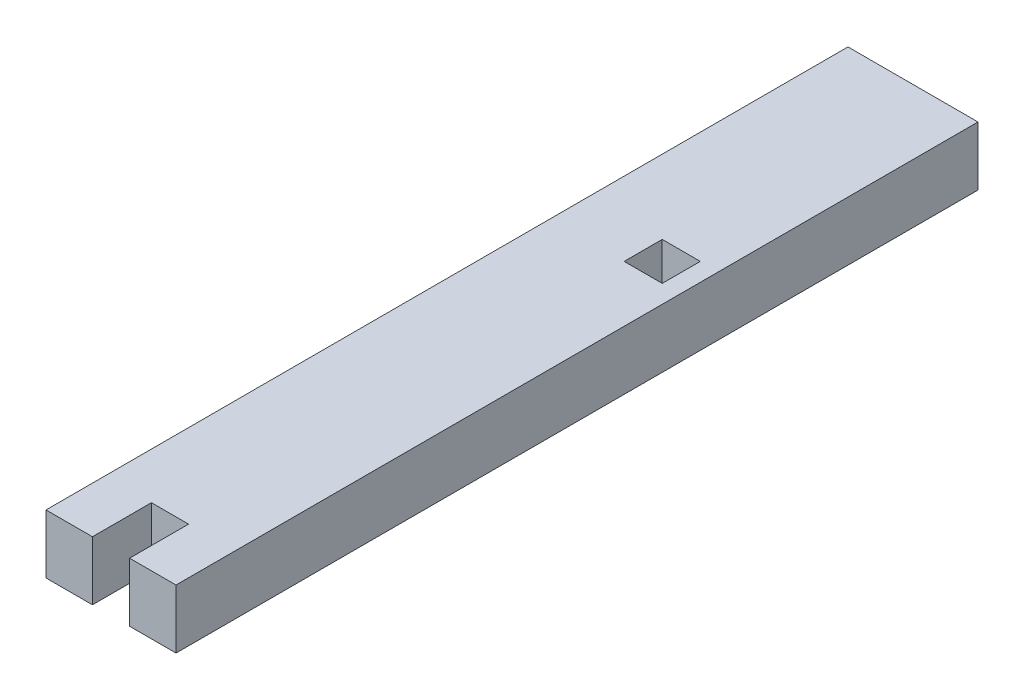
ISO-10303-21;
HEADER;
FILE_DESCRIPTION(('STEP AP214'),'2;1');
FILE_NAME('part.step','',(''),(''),'','','');
FILE_SCHEMA(('AUTOMOTIVE_DESIGN { 1 0 10303 214 1 1 1 1 }'));
ENDSEC;
DATA;
#1=APPLICATION_CONTEXT('core data for automotive mechanical design processes');
#2=APPLICATION_PROTOCOL_DEFINITION('international standard','automotive_design',2000,#1);
#3=PRODUCT_CONTEXT('',#1,'mechanical');
#4=PRODUCT('Part','Part','',(#3));
#5=PRODUCT_RELATED_PRODUCT_CATEGORY('part','',(#4));
#6=PRODUCT_DEFINITION_FORMATION('','',#4);
#7=PRODUCT_DEFINITION_CONTEXT('part definition',#1,'design');
#8=PRODUCT_DEFINITION('design','',#6,#7);
#9=PRODUCT_DEFINITION_SHAPE('','',#8);
#10=(LENGTH_UNIT() NAMED_UNIT(*) SI_UNIT(.MILLI.,.METRE.));
#11=(NAMED_UNIT(*) PLANE_ANGLE_UNIT() SI_UNIT($,.RADIAN.));
#12=(NAMED_UNIT(*) SI_UNIT($,.STERADIAN.) SOLID_ANGLE_UNIT());
#13=UNCERTAINTY_MEASURE_WITH_UNIT(LENGTH_MEASURE(1.E-05),#10,'distance_accuracy_value','');
#14=(GEOMETRIC_REPRESENTATION_CONTEXT(3) GLOBAL_UNCERTAINTY_ASSIGNED_CONTEXT((#13)) GLOBAL_UNIT_ASSIGNED_CONTEXT((#10,
#11,#12)) REPRESENTATION_CONTEXT('',''));
#15=CARTESIAN_POINT('',(0.,0.,0.));
#16=DIRECTION('',(0.,0.,1.));
#17=DIRECTION('',(1.,0.,0.));
#18=AXIS2_PLACEMENT_3D('',#15,#16,#17);
#19=CARTESIAN_POINT('',(0.,3.175,-7.612500005));
#20=DIRECTION('',(0.,0.,-1.));
#21=DIRECTION('',(-1.,0.,0.));
#22=AXIS2_PLACEMENT_3D('',#19,#20,#21);
#23=PLANE('',#22);
#24=DIRECTION('',(1.,0.,0.));
#25=VECTOR('',#24,1.);
#26=CARTESIAN_POINT('',(0.,0.,-7.612500005));
#27=LINE('',#26,#25);
#28=CARTESIAN_POINT('',(0.474999999999999,0.,-7.612500005));
#29=VERTEX_POINT('',#28);
#30=CARTESIAN_POINT('',(2.525,0.,-7.612500005));
#31=VERTEX_POINT('',#30);
#32=EDGE_CURVE('E176',#29,#31,#27,.T.);
#33=ORIENTED_EDGE('',*,*,#32,.T.);
#34=DIRECTION('',(0.,-1.,0.));
#35=VECTOR('',#34,1.);
#36=CARTESIAN_POINT('',(2.525,3.175,-7.612500005));
#37=LINE('',#36,#35);
#38=CARTESIAN_POINT('',(2.525,3.175,-7.612500005));
#39=VERTEX_POINT('',#38);
#40=EDGE_CURVE('E11',#39,#31,#37,.T.);
#41=ORIENTED_EDGE('',*,*,#40,.F.);
#42=DIRECTION('',(1.,0.,0.));
#43=VECTOR('',#42,1.);
#44=CARTESIAN_POINT('',(0.,3.175,-7.612500005));
#45=LINE('',#44,#43);
#46=CARTESIAN_POINT('',(0.474999999999999,3.175,-7.612500005));
#47=VERTEX_POINT('',#46);
#48=EDGE_CURVE('E139',#47,#39,#45,.T.);
#49=ORIENTED_EDGE('',*,*,#48,.F.);
#50=DIRECTION('',(0.,-1.,0.));
#51=VECTOR('',#50,1.);
#52=CARTESIAN_POINT('',(0.474999999999999,3.175,-7.612500005));
#53=LINE('',#52,#51);
#54=EDGE_CURVE('E55',#47,#29,#53,.T.);
#55=ORIENTED_EDGE('',*,*,#54,.T.);
#56=EDGE_LOOP('',(#33,#41,#49,#55));
#57=FACE_BOUND('',#56,.T.);
#58=ADVANCED_FACE('F36',(#57),#23,.F.);
#59=CARTESIAN_POINT('',(2.525,3.175,0.));
#60=DIRECTION('',(1.,0.,0.));
#61=DIRECTION('',(0.,0.,-1.));
#62=AXIS2_PLACEMENT_3D('',#59,#60,#61);
#63=PLANE('',#62);
#64=DIRECTION('',(0.,0.,1.));
#65=VECTOR('',#64,1.);
#66=CARTESIAN_POINT('',(2.525,0.,0.));
#67=LINE('',#66,#65);
#68=CARTESIAN_POINT('',(2.525,0.,-5.562500005));
#69=VERTEX_POINT('',#68);
#70=EDGE_CURVE('E145',#31,#69,#67,.T.);
#71=ORIENTED_EDGE('',*,*,#70,.T.);
#72=DIRECTION('',(0.,-1.,0.));
#73=VECTOR('',#72,1.);
#74=CARTESIAN_POINT('',(2.525,3.175,-5.562500005));
#75=LINE('',#74,#73);
#76=CARTESIAN_POINT('',(2.525,3.175,-5.562500005));
#77=VERTEX_POINT('',#76);
#78=EDGE_CURVE('E46',#77,#69,#75,.T.);
#79=ORIENTED_EDGE('',*,*,#78,.F.);
#80=DIRECTION('',(0.,0.,1.));
#81=VECTOR('',#80,1.);
#82=CARTESIAN_POINT('',(2.525,3.175,0.));
#83=LINE('',#82,#81);
#84=EDGE_CURVE('E133',#39,#77,#83,.T.);
#85=ORIENTED_EDGE('',*,*,#84,.F.);
#86=ORIENTED_EDGE('',*,*,#40,.T.);
#87=EDGE_LOOP('',(#71,#79,#85,#86));
#88=FACE_BOUND('',#87,.T.);
#89=ADVANCED_FACE('F144',(#88),#63,.F.);
#90=CARTESIAN_POINT('',(0.,3.175,-5.562500005));
#91=DIRECTION('',(0.,0.,-1.));
#92=DIRECTION('',(-1.,0.,0.));
#93=AXIS2_PLACEMENT_3D('',#90,#91,#92);
#94=PLANE('',#93);
#95=DIRECTION('',(1.,0.,0.));
#96=VECTOR('',#95,1.);
#97=CARTESIAN_POINT('',(0.,0.,-5.562500005));
#98=LINE('',#97,#96);
#99=CARTESIAN_POINT('',(0.474999999999999,0.,-5.562500005));
#100=VERTEX_POINT('',#99);
#101=EDGE_CURVE('E179',#100,#69,#98,.T.);
#102=ORIENTED_EDGE('',*,*,#101,.F.);
#103=DIRECTION('',(0.,-1.,0.));
#104=VECTOR('',#103,1.);
#105=CARTESIAN_POINT('',(0.474999999999999,3.175,-5.562500005));
#106=LINE('',#105,#104);
#107=CARTESIAN_POINT('',(0.474999999999999,3.175,-5.562500005));
#108=VERTEX_POINT('',#107);
#109=EDGE_CURVE('E93',#108,#100,#106,.T.);
#110=ORIENTED_EDGE('',*,*,#109,.F.);
#111=DIRECTION('',(1.,0.,0.));
#112=VECTOR('',#111,1.);
#113=CARTESIAN_POINT('',(0.,3.175,-5.562500005));
#114=LINE('',#113,#112);
#115=EDGE_CURVE('E138',#108,#77,#114,.T.);
#116=ORIENTED_EDGE('',*,*,#115,.T.);
#117=ORIENTED_EDGE('',*,*,#78,.T.);
#118=EDGE_LOOP('',(#102,#110,#116,#117));
#119=FACE_BOUND('',#118,.T.);
#120=ADVANCED_FACE('F149',(#119),#94,.T.);
#121=CARTESIAN_POINT('',(0.999999999999978,3.175,0.));
#122=DIRECTION('',(-1.,0.,0.));
#123=DIRECTION('',(0.,0.,1.));
#124=AXIS2_PLACEMENT_3D('',#121,#122,#123);
#125=PLANE('',#124);
#126=DIRECTION('',(0.,0.,-1.));
#127=VECTOR('',#126,1.);
#128=CARTESIAN_POINT('',(0.999999999999978,0.,0.));
#129=LINE('',#128,#127);
#130=CARTESIAN_POINT('',(1.,0.,21.587500005));
#131=VERTEX_POINT('',#130);
#132=CARTESIAN_POINT('',(0.999999999999998,0.,18.412500005));
#133=VERTEX_POINT('',#132);
#134=EDGE_CURVE('E156',#131,#133,#129,.T.);
#135=ORIENTED_EDGE('',*,*,#134,.F.);
#136=DIRECTION('',(0.,-1.,0.));
#137=VECTOR('',#136,1.);
#138=CARTESIAN_POINT('',(1.,3.175,21.587500005));
#139=LINE('',#138,#137);
#140=CARTESIAN_POINT('',(1.,3.175,21.587500005));
#141=VERTEX_POINT('',#140);
#142=EDGE_CURVE('E40',#141,#131,#139,.T.);
#143=ORIENTED_EDGE('',*,*,#142,.F.);
#144=DIRECTION('',(0.,0.,-1.));
#145=VECTOR('',#144,1.);
#146=CARTESIAN_POINT('',(0.999999999999978,3.175,0.));
#147=LINE('',#146,#145);
#148=CARTESIAN_POINT('',(0.999999999999998,3.175,18.412500005));
#149=VERTEX_POINT('',#148);
#150=EDGE_CURVE('E184',#141,#149,#147,.T.);
#151=ORIENTED_EDGE('',*,*,#150,.T.);
#152=DIRECTION('',(0.,-1.,0.));
#153=VECTOR('',#152,1.);
#154=CARTESIAN_POINT('',(0.999999999999998,3.175,18.412500005));
#155=LINE('',#154,#153);
#156=EDGE_CURVE('E152',#149,#133,#155,.T.);
#157=ORIENTED_EDGE('',*,*,#156,.T.);
#158=EDGE_LOOP('',(#135,#143,#151,#157));
#159=FACE_BOUND('',#158,.T.);
#160=ADVANCED_FACE('F38',(#159),#125,.T.);
#161=CARTESIAN_POINT('',(0.,3.175,21.587500005));
#162=DIRECTION('',(0.,0.,1.));
#163=DIRECTION('',(1.,0.,0.));
#164=AXIS2_PLACEMENT_3D('',#161,#162,#163);
#165=PLANE('',#164);
#166=DIRECTION('',(-1.,0.,0.));
#167=VECTOR('',#166,1.);
#168=CARTESIAN_POINT('',(0.,0.,21.587500005));
#169=LINE('',#168,#167);
#170=CARTESIAN_POINT('',(3.5,0.,21.587500005));
#171=VERTEX_POINT('',#170);
#172=EDGE_CURVE('E159',#171,#131,#169,.T.);
#173=ORIENTED_EDGE('',*,*,#172,.F.);
#174=DIRECTION('',(0.,-1.,0.));
#175=VECTOR('',#174,1.);
#176=CARTESIAN_POINT('',(3.5,3.175,21.587500005));
#177=LINE('',#176,#175);
#178=CARTESIAN_POINT('',(3.5,3.175,21.587500005));
#179=VERTEX_POINT('',#178);
#180=EDGE_CURVE('E199',#179,#171,#177,.T.);
#181=ORIENTED_EDGE('',*,*,#180,.F.);
#182=DIRECTION('',(-1.,0.,0.));
#183=VECTOR('',#182,1.);
#184=CARTESIAN_POINT('',(0.,3.175,21.587500005));
#185=LINE('',#184,#183);
#186=EDGE_CURVE('E208',#179,#141,#185,.T.);
#187=ORIENTED_EDGE('',*,*,#186,.T.);
#188=ORIENTED_EDGE('',*,*,#142,.T.);
#189=EDGE_LOOP('',(#173,#181,#187,#188));
#190=FACE_BOUND('',#189,.T.);
#191=ADVANCED_FACE('F206',(#190),#165,.T.);
#192=CARTESIAN_POINT('',(3.5,3.175,0.));
#193=DIRECTION('',(-1.,0.,0.));
#194=DIRECTION('',(0.,0.,1.));
#195=AXIS2_PLACEMENT_3D('',#192,#193,#194);
#196=PLANE('',#195);
#197=DIRECTION('',(0.,0.,-1.));
#198=VECTOR('',#197,1.);
#199=CARTESIAN_POINT('',(3.5,0.,0.));
#200=LINE('',#199,#198);
#201=CARTESIAN_POINT('',(3.5,0.,-21.587500005));
#202=VERTEX_POINT('',#201);
#203=EDGE_CURVE('E162',#171,#202,#200,.T.);
#204=ORIENTED_EDGE('',*,*,#203,.T.);
#205=DIRECTION('',(0.,-1.,0.));
#206=VECTOR('',#205,1.);
#207=CARTESIAN_POINT('',(3.5,3.175,-21.587500005));
#208=LINE('',#207,#206);
#209=CARTESIAN_POINT('',(3.5,3.175,-21.587500005));
#210=VERTEX_POINT('',#209);
#211=EDGE_CURVE('E197',#210,#202,#208,.T.);
#212=ORIENTED_EDGE('',*,*,#211,.F.);
#213=DIRECTION('',(0.,0.,-1.));
#214=VECTOR('',#213,1.);
#215=CARTESIAN_POINT('',(3.5,3.175,0.));
#216=LINE('',#215,#214);
#217=EDGE_CURVE('E226',#179,#210,#216,.T.);
#218=ORIENTED_EDGE('',*,*,#217,.F.);
#219=ORIENTED_EDGE('',*,*,#180,.T.);
#220=EDGE_LOOP('',(#204,#212,#218,#219));
#221=FACE_BOUND('',#220,.T.);
#222=ADVANCED_FACE('F216',(#221),#196,.F.);
#223=CARTESIAN_POINT('',(0.,3.175,-21.587500005));
#224=DIRECTION('',(0.,0.,1.));
#225=DIRECTION('',(1.,0.,0.));
#226=AXIS2_PLACEMENT_3D('',#223,#224,#225);
#227=PLANE('',#226);
#228=DIRECTION('',(-1.,0.,0.));
#229=VECTOR('',#228,1.);
#230=CARTESIAN_POINT('',(0.,0.,-21.587500005));
#231=LINE('',#230,#229);
#232=CARTESIAN_POINT('',(-3.5,0.,-21.587500005));
#233=VERTEX_POINT('',#232);
#234=EDGE_CURVE('E165',#202,#233,#231,.T.);
#235=ORIENTED_EDGE('',*,*,#234,.T.);
#236=DIRECTION('',(0.,-1.,0.));
#237=VECTOR('',#236,1.);
#238=CARTESIAN_POINT('',(-3.5,3.175,-21.587500005));
#239=LINE('',#238,#237);
#240=CARTESIAN_POINT('',(-3.5,3.175,-21.587500005));
#241=VERTEX_POINT('',#240);
#242=EDGE_CURVE('E195',#241,#233,#239,.T.);
#243=ORIENTED_EDGE('',*,*,#242,.F.);
#244=DIRECTION('',(-1.,0.,0.));
#245=VECTOR('',#244,1.);
#246=CARTESIAN_POINT('',(0.,3.175,-21.587500005));
#247=LINE('',#246,#245);
#248=EDGE_CURVE('E221',#210,#241,#247,.T.);
#249=ORIENTED_EDGE('',*,*,#248,.F.);
#250=ORIENTED_EDGE('',*,*,#211,.T.);
#251=EDGE_LOOP('',(#235,#243,#249,#250));
#252=FACE_BOUND('',#251,.T.);
#253=ADVANCED_FACE('F219',(#252),#227,.F.);
#254=CARTESIAN_POINT('',(-3.5,3.175,0.));
#255=DIRECTION('',(-1.,0.,0.));
#256=DIRECTION('',(0.,0.,1.));
#257=AXIS2_PLACEMENT_3D('',#254,#255,#256);
#258=PLANE('',#257);
#259=DIRECTION('',(0.,0.,-1.));
#260=VECTOR('',#259,1.);
#261=CARTESIAN_POINT('',(-3.5,0.,0.));
#262=LINE('',#261,#260);
#263=CARTESIAN_POINT('',(-3.5,0.,21.587500005));
#264=VERTEX_POINT('',#263);
#265=EDGE_CURVE('E168',#264,#233,#262,.T.);
#266=ORIENTED_EDGE('',*,*,#265,.F.);
#267=DIRECTION('',(0.,-1.,0.));
#268=VECTOR('',#267,1.);
#269=CARTESIAN_POINT('',(-3.5,3.175,21.587500005));
#270=LINE('',#269,#268);
#271=CARTESIAN_POINT('',(-3.5,3.175,21.587500005));
#272=VERTEX_POINT('',#271);
#273=EDGE_CURVE('E193',#272,#264,#270,.T.);
#274=ORIENTED_EDGE('',*,*,#273,.F.);
#275=DIRECTION('',(0.,0.,-1.));
#276=VECTOR('',#275,1.);
#277=CARTESIAN_POINT('',(-3.5,3.175,0.));
#278=LINE('',#277,#276);
#279=EDGE_CURVE('E225',#272,#241,#278,.T.);
#280=ORIENTED_EDGE('',*,*,#279,.T.);
#281=ORIENTED_EDGE('',*,*,#242,.T.);
#282=EDGE_LOOP('',(#266,#274,#280,#281));
#283=FACE_BOUND('',#282,.T.);
#284=ADVANCED_FACE('F249',(#283),#258,.T.);
#285=CARTESIAN_POINT('',(-1.,0.,21.587500005));
#286=VERTEX_POINT('',#285);
#287=EDGE_CURVE('E163',#286,#264,#169,.T.);
#288=ORIENTED_EDGE('',*,*,#287,.F.);
#289=DIRECTION('',(0.,-1.,0.));
#290=VECTOR('',#289,1.);
#291=CARTESIAN_POINT('',(-1.,3.175,21.587500005));
#292=LINE('',#291,#290);
#293=CARTESIAN_POINT('',(-1.,3.175,21.587500005));
#294=VERTEX_POINT('',#293);
#295=EDGE_CURVE('E191',#294,#286,#292,.T.);
#296=ORIENTED_EDGE('',*,*,#295,.F.);
#297=EDGE_CURVE('E228',#294,#272,#185,.T.);
#298=ORIENTED_EDGE('',*,*,#297,.T.);
#299=ORIENTED_EDGE('',*,*,#273,.T.);
#300=EDGE_LOOP('',(#288,#296,#298,#299));
#301=FACE_BOUND('',#300,.T.);
#302=ADVANCED_FACE('F246',(#301),#165,.T.);
#303=CARTESIAN_POINT('',(-1.,3.175,0.));
#304=DIRECTION('',(-1.,0.,0.));
#305=DIRECTION('',(0.,0.,1.));
#306=AXIS2_PLACEMENT_3D('',#303,#304,#305);
#307=PLANE('',#306);
#308=DIRECTION('',(0.,0.,-1.));
#309=VECTOR('',#308,1.);
#310=CARTESIAN_POINT('',(-1.,0.,0.));
#311=LINE('',#310,#309);
#312=CARTESIAN_POINT('',(-1.,0.,18.412500005));
#313=VERTEX_POINT('',#312);
#314=EDGE_CURVE('E171',#286,#313,#311,.T.);
#315=ORIENTED_EDGE('',*,*,#314,.T.);
#316=DIRECTION('',(0.,-1.,0.));
#317=VECTOR('',#316,1.);
#318=CARTESIAN_POINT('',(-1.,3.175,18.412500005));
#319=LINE('',#318,#317);
#320=CARTESIAN_POINT('',(-1.,3.175,18.412500005));
#321=VERTEX_POINT('',#320);
#322=EDGE_CURVE('E188',#321,#313,#319,.T.);
#323=ORIENTED_EDGE('',*,*,#322,.F.);
#324=DIRECTION('',(0.,0.,-1.));
#325=VECTOR('',#324,1.);
#326=CARTESIAN_POINT('',(-1.,3.175,0.));
#327=LINE('',#326,#325);
#328=EDGE_CURVE('E233',#294,#321,#327,.T.);
#329=ORIENTED_EDGE('',*,*,#328,.F.);
#330=ORIENTED_EDGE('',*,*,#295,.T.);
#331=EDGE_LOOP('',(#315,#323,#329,#330));
#332=FACE_BOUND('',#331,.T.);
#333=ADVANCED_FACE('F253',(#332),#307,.F.);
#334=CARTESIAN_POINT('',(0.,3.175,18.412500005));
#335=DIRECTION('',(0.,0.,-1.));
#336=DIRECTION('',(-1.,0.,0.));
#337=AXIS2_PLACEMENT_3D('',#334,#335,#336);
#338=PLANE('',#337);
#339=DIRECTION('',(1.,0.,0.));
#340=VECTOR('',#339,1.);
#341=CARTESIAN_POINT('',(0.,0.,18.412500005));
#342=LINE('',#341,#340);
#343=EDGE_CURVE('E173',#313,#133,#342,.T.);
#344=ORIENTED_EDGE('',*,*,#343,.T.);
#345=ORIENTED_EDGE('',*,*,#156,.F.);
#346=DIRECTION('',(1.,0.,0.));
#347=VECTOR('',#346,1.);
#348=CARTESIAN_POINT('',(0.,3.175,18.412500005));
#349=LINE('',#348,#347);
#350=EDGE_CURVE('E235',#321,#149,#349,.T.);
#351=ORIENTED_EDGE('',*,*,#350,.F.);
#352=ORIENTED_EDGE('',*,*,#322,.T.);
#353=EDGE_LOOP('',(#344,#345,#351,#352));
#354=FACE_BOUND('',#353,.T.);
#355=ADVANCED_FACE('F241',(#354),#338,.F.);
#356=CARTESIAN_POINT('',(0.475,3.175,0.));
#357=DIRECTION('',(1.,0.,0.));
#358=DIRECTION('',(0.,0.,-1.));
#359=AXIS2_PLACEMENT_3D('',#356,#357,#358);
#360=PLANE('',#359);
#361=DIRECTION('',(0.,0.,1.));
#362=VECTOR('',#361,1.);
#363=CARTESIAN_POINT('',(0.475,0.,0.));
#364=LINE('',#363,#362);
#365=EDGE_CURVE('E181',#29,#100,#364,.T.);
#366=ORIENTED_EDGE('',*,*,#365,.F.);
#367=ORIENTED_EDGE('',*,*,#54,.F.);
#368=DIRECTION('',(0.,0.,1.));
#369=VECTOR('',#368,1.);
#370=CARTESIAN_POINT('',(0.475,3.175,0.));
#371=LINE('',#370,#369);
#372=EDGE_CURVE('E150',#47,#108,#371,.T.);
#373=ORIENTED_EDGE('',*,*,#372,.T.);
#374=ORIENTED_EDGE('',*,*,#109,.T.);
#375=EDGE_LOOP('',(#366,#367,#373,#374));
#376=FACE_BOUND('',#375,.T.);
#377=ADVANCED_FACE('F260',(#376),#360,.T.);
#378=CARTESIAN_POINT('',(0.,3.175,0.));
#379=DIRECTION('',(0.,1.,0.));
#380=DIRECTION('',(0.,0.,1.));
#381=AXIS2_PLACEMENT_3D('',#378,#379,#380);
#382=PLANE('',#381);
#383=ORIENTED_EDGE('',*,*,#150,.F.);
#384=ORIENTED_EDGE('',*,*,#186,.F.);
#385=ORIENTED_EDGE('',*,*,#217,.T.);
#386=ORIENTED_EDGE('',*,*,#248,.T.);
#387=ORIENTED_EDGE('',*,*,#279,.F.);
#388=ORIENTED_EDGE('',*,*,#297,.F.);
#389=ORIENTED_EDGE('',*,*,#328,.T.);
#390=ORIENTED_EDGE('',*,*,#350,.T.);
#391=EDGE_LOOP('',(#383,#384,#385,#386,#387,#388,#389,#390));
#392=FACE_BOUND('',#391,.T.);
#393=ORIENTED_EDGE('',*,*,#48,.T.);
#394=ORIENTED_EDGE('',*,*,#84,.T.);
#395=ORIENTED_EDGE('',*,*,#115,.F.);
#396=ORIENTED_EDGE('',*,*,#372,.F.);
#397=EDGE_LOOP('',(#393,#394,#395,#396));
#398=FACE_BOUND('',#397,.T.);
#399=ADVANCED_FACE('F135',(#392,#398),#382,.T.);
#400=CARTESIAN_POINT('',(0.,0.,0.));
#401=DIRECTION('',(0.,1.,0.));
#402=DIRECTION('',(0.,0.,1.));
#403=AXIS2_PLACEMENT_3D('',#400,#401,#402);
#404=PLANE('',#403);
#405=ORIENTED_EDGE('',*,*,#134,.T.);
#406=ORIENTED_EDGE('',*,*,#343,.F.);
#407=ORIENTED_EDGE('',*,*,#314,.F.);
#408=ORIENTED_EDGE('',*,*,#287,.T.);
#409=ORIENTED_EDGE('',*,*,#265,.T.);
#410=ORIENTED_EDGE('',*,*,#234,.F.);
#411=ORIENTED_EDGE('',*,*,#203,.F.);
#412=ORIENTED_EDGE('',*,*,#172,.T.);
#413=EDGE_LOOP('',(#405,#406,#407,#408,#409,#410,#411,#412));
#414=FACE_BOUND('',#413,.T.);
#415=ORIENTED_EDGE('',*,*,#32,.F.);
#416=ORIENTED_EDGE('',*,*,#365,.T.);
#417=ORIENTED_EDGE('',*,*,#101,.T.);
#418=ORIENTED_EDGE('',*,*,#70,.F.);
#419=EDGE_LOOP('',(#415,#416,#417,#418));
#420=FACE_BOUND('',#419,.T.);
#421=ADVANCED_FACE('F212',(#414,#420),#404,.F.);
#422=CLOSED_SHELL('',(#58,#89,#120,#160,#191,#222,#253,#284,#302,#333,#355,#377,#399,#421));
#423=MANIFOLD_SOLID_BREP('B2',#422);
#424=ADVANCED_BREP_SHAPE_REPRESENTATION('',(#18,#423),#14);
#425=SHAPE_DEFINITION_REPRESENTATION(#9,#424);
ENDSEC;
END-ISO-10303-21;
